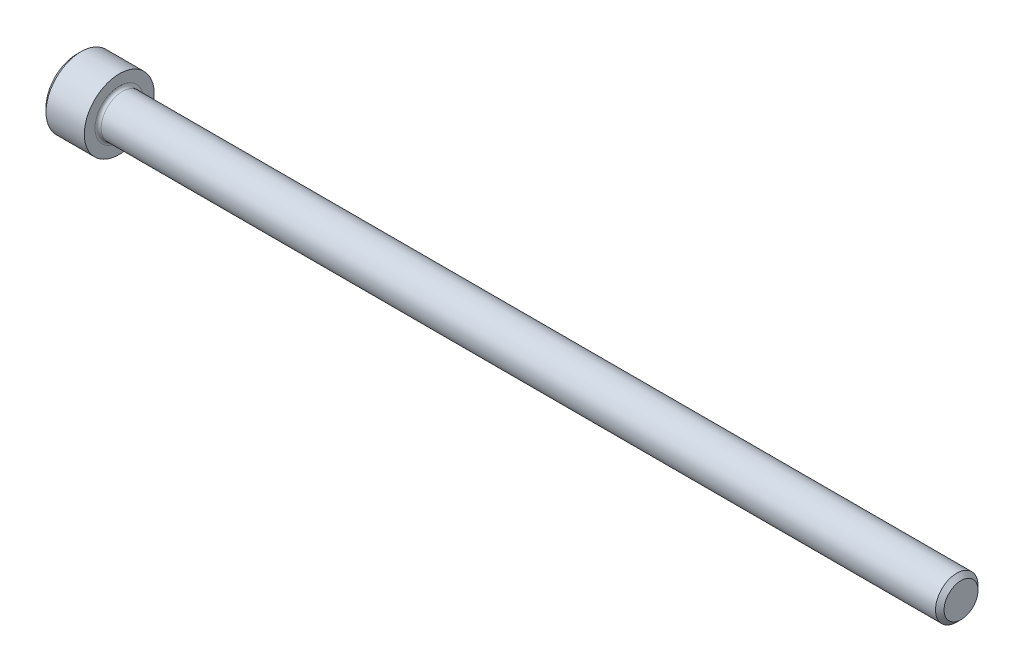
ISO-10303-21;
HEADER;
FILE_DESCRIPTION(('STEP AP214'),'2;1');
FILE_NAME('part.step','',(''),(''),'','','');
FILE_SCHEMA(('AUTOMOTIVE_DESIGN { 1 0 10303 214 1 1 1 1 }'));
ENDSEC;
DATA;
#1=APPLICATION_CONTEXT('core data for automotive mechanical design processes');
#2=APPLICATION_PROTOCOL_DEFINITION('international standard','automotive_design',2000,#1);
#3=PRODUCT_CONTEXT('',#1,'mechanical');
#4=PRODUCT('Part','Part','',(#3));
#5=PRODUCT_RELATED_PRODUCT_CATEGORY('part','',(#4));
#6=PRODUCT_DEFINITION_FORMATION('','',#4);
#7=PRODUCT_DEFINITION_CONTEXT('part definition',#1,'design');
#8=PRODUCT_DEFINITION('design','',#6,#7);
#9=PRODUCT_DEFINITION_SHAPE('','',#8);
#10=(LENGTH_UNIT() NAMED_UNIT(*) SI_UNIT(.MILLI.,.METRE.));
#11=(NAMED_UNIT(*) PLANE_ANGLE_UNIT() SI_UNIT($,.RADIAN.));
#12=(NAMED_UNIT(*) SI_UNIT($,.STERADIAN.) SOLID_ANGLE_UNIT());
#13=UNCERTAINTY_MEASURE_WITH_UNIT(LENGTH_MEASURE(1.E-05),#10,'distance_accuracy_value','');
#14=(GEOMETRIC_REPRESENTATION_CONTEXT(3) GLOBAL_UNCERTAINTY_ASSIGNED_CONTEXT((#13)) GLOBAL_UNIT_ASSIGNED_CONTEXT((#10,
#11,#12)) REPRESENTATION_CONTEXT('',''));
#15=CARTESIAN_POINT('',(0.,0.,0.));
#16=DIRECTION('',(0.,0.,1.));
#17=DIRECTION('',(1.,0.,0.));
#18=AXIS2_PLACEMENT_3D('',#15,#16,#17);
#19=CARTESIAN_POINT('',(0.,0.,0.));
#20=DIRECTION('',(-1.,0.,0.));
#21=DIRECTION('',(0.,0.,1.));
#22=AXIS2_PLACEMENT_3D('',#19,#20,#21);
#23=PLANE('',#22);
#24=DIRECTION('',(0.,-0.499999999999999,0.866025403784439));
#25=VECTOR('',#24,1.);
#26=CARTESIAN_POINT('',(0.,2.05305755723831,0.));
#27=LINE('',#26,#25);
#28=CARTESIAN_POINT('',(0.,2.05305755723831,0.));
#29=VERTEX_POINT('',#28);
#30=CARTESIAN_POINT('',(0.,1.02652877861916,1.778));
#31=VERTEX_POINT('',#30);
#32=EDGE_CURVE('E373',#29,#31,#27,.T.);
#33=ORIENTED_EDGE('',*,*,#32,.T.);
#34=DIRECTION('',(0.,1.,0.));
#35=VECTOR('',#34,1.);
#36=CARTESIAN_POINT('',(0.,-1.02652877861915,1.778));
#37=LINE('',#36,#35);
#38=CARTESIAN_POINT('',(0.,-1.02652877861915,1.778));
#39=VERTEX_POINT('',#38);
#40=EDGE_CURVE('E129',#39,#31,#37,.T.);
#41=ORIENTED_EDGE('',*,*,#40,.F.);
#42=DIRECTION('',(0.,-0.500000000000001,-0.866025403784438));
#43=VECTOR('',#42,1.);
#44=CARTESIAN_POINT('',(0.,-1.02652877861915,1.778));
#45=LINE('',#44,#43);
#46=CARTESIAN_POINT('',(0.,-2.05305755723831,0.));
#47=VERTEX_POINT('',#46);
#48=EDGE_CURVE('E376',#39,#47,#45,.T.);
#49=ORIENTED_EDGE('',*,*,#48,.T.);
#50=DIRECTION('',(0.,0.499999999999999,-0.866025403784439));
#51=VECTOR('',#50,1.);
#52=CARTESIAN_POINT('',(0.,-2.05305755723831,0.));
#53=LINE('',#52,#51);
#54=CARTESIAN_POINT('',(0.,-1.02652877861915,-1.778));
#55=VERTEX_POINT('',#54);
#56=EDGE_CURVE('E379',#47,#55,#53,.T.);
#57=ORIENTED_EDGE('',*,*,#56,.T.);
#58=DIRECTION('',(0.,-1.,0.));
#59=VECTOR('',#58,1.);
#60=CARTESIAN_POINT('',(0.,1.02652877861916,-1.778));
#61=LINE('',#60,#59);
#62=CARTESIAN_POINT('',(0.,1.02652877861916,-1.778));
#63=VERTEX_POINT('',#62);
#64=EDGE_CURVE('E382',#63,#55,#61,.T.);
#65=ORIENTED_EDGE('',*,*,#64,.F.);
#66=DIRECTION('',(0.,-0.500000000000001,-0.866025403784438));
#67=VECTOR('',#66,1.);
#68=CARTESIAN_POINT('',(0.,2.05305755723831,0.));
#69=LINE('',#68,#67);
#70=EDGE_CURVE('E124',#29,#63,#69,.T.);
#71=ORIENTED_EDGE('',*,*,#70,.F.);
#72=EDGE_LOOP('',(#33,#41,#49,#57,#65,#71));
#73=FACE_BOUND('',#72,.T.);
#74=CARTESIAN_POINT('',(0.,0.,0.));
#75=DIRECTION('',(-1.,0.,0.));
#76=DIRECTION('',(0.,0.,1.));
#77=AXIS2_PLACEMENT_3D('',#74,#75,#76);
#78=CIRCLE('',#77,3.0226);
#79=CARTESIAN_POINT('',(0.,0.,3.0226));
#80=VERTEX_POINT('',#79);
#81=EDGE_CURVE('E140',#80,#80,#78,.T.);
#82=ORIENTED_EDGE('',*,*,#81,.T.);
#83=EDGE_LOOP('',(#82));
#84=FACE_BOUND('',#83,.T.);
#85=ADVANCED_FACE('F33',(#73,#84),#23,.T.);
#86=CARTESIAN_POINT('',(86.7156,1.66243,0.));
#87=DIRECTION('',(1.,0.,0.));
#88=DIRECTION('',(0.,0.,-1.));
#89=AXIS2_PLACEMENT_3D('',#86,#87,#88);
#90=PLANE('',#89);
#91=CARTESIAN_POINT('',(86.7156,0.,0.));
#92=DIRECTION('',(-1.,0.,0.));
#93=DIRECTION('',(0.,0.,1.));
#94=AXIS2_PLACEMENT_3D('',#91,#92,#93);
#95=CIRCLE('',#94,1.66243);
#96=CARTESIAN_POINT('',(86.7156,0.,1.66243));
#97=VERTEX_POINT('',#96);
#98=EDGE_CURVE('E153',#97,#97,#95,.T.);
#99=ORIENTED_EDGE('',*,*,#98,.F.);
#100=EDGE_LOOP('',(#99));
#101=FACE_BOUND('',#100,.T.);
#102=ADVANCED_FACE('F174',(#101),#90,.T.);
#103=CARTESIAN_POINT('',(86.7156,0.,0.));
#104=DIRECTION('',(-1.,0.,0.));
#105=DIRECTION('',(0.,0.,1.));
#106=AXIS2_PLACEMENT_3D('',#103,#104,#105);
#107=CONICAL_SURFACE('',#106,1.66243,0.785398163397446);
#108=CARTESIAN_POINT('',(86.29523,0.,0.));
#109=DIRECTION('',(-1.,0.,0.));
#110=DIRECTION('',(0.,0.,1.));
#111=AXIS2_PLACEMENT_3D('',#108,#109,#110);
#112=CIRCLE('',#111,2.0828);
#113=CARTESIAN_POINT('',(86.29523,0.,2.0828));
#114=VERTEX_POINT('',#113);
#115=EDGE_CURVE('E150',#114,#114,#112,.T.);
#116=ORIENTED_EDGE('',*,*,#115,.F.);
#117=EDGE_LOOP('',(#116));
#118=FACE_BOUND('',#117,.T.);
#119=ORIENTED_EDGE('',*,*,#98,.T.);
#120=EDGE_LOOP('',(#119));
#121=FACE_BOUND('',#120,.T.);
#122=ADVANCED_FACE('F180',(#118,#121),#107,.T.);
#123=CARTESIAN_POINT('',(-31.75,0.,0.));
#124=DIRECTION('',(-1.,0.,0.));
#125=DIRECTION('',(0.,0.,1.));
#126=AXIS2_PLACEMENT_3D('',#123,#124,#125);
#127=CYLINDRICAL_SURFACE('',#126,2.0828);
#128=CARTESIAN_POINT('',(4.47040000000001,0.,0.));
#129=DIRECTION('',(1.,0.,0.));
#130=DIRECTION('',(0.,0.,-1.));
#131=AXIS2_PLACEMENT_3D('',#128,#129,#130);
#132=CIRCLE('',#131,2.0828);
#133=CARTESIAN_POINT('',(4.47040000000001,0.,-2.0828));
#134=VERTEX_POINT('',#133);
#135=EDGE_CURVE('E11',#134,#134,#132,.T.);
#136=ORIENTED_EDGE('',*,*,#135,.T.);
#137=EDGE_LOOP('',(#136));
#138=FACE_BOUND('',#137,.T.);
#139=ORIENTED_EDGE('',*,*,#115,.T.);
#140=EDGE_LOOP('',(#139));
#141=FACE_BOUND('',#140,.T.);
#142=ADVANCED_FACE('F191',(#138,#141),#127,.T.);
#143=CARTESIAN_POINT('',(4.1656,3.429,0.));
#144=DIRECTION('',(1.,0.,0.));
#145=DIRECTION('',(0.,0.,-1.));
#146=AXIS2_PLACEMENT_3D('',#143,#144,#145);
#147=PLANE('',#146);
#148=CARTESIAN_POINT('',(4.1656,0.,0.));
#149=DIRECTION('',(1.,0.,0.));
#150=DIRECTION('',(0.,0.,-1.));
#151=AXIS2_PLACEMENT_3D('',#148,#149,#150);
#152=CIRCLE('',#151,2.3876);
#153=CARTESIAN_POINT('',(4.1656,0.,-2.3876));
#154=VERTEX_POINT('',#153);
#155=EDGE_CURVE('E41',#154,#154,#152,.F.);
#156=ORIENTED_EDGE('',*,*,#155,.T.);
#157=EDGE_LOOP('',(#156));
#158=FACE_BOUND('',#157,.T.);
#159=CARTESIAN_POINT('',(4.1656,0.,0.));
#160=DIRECTION('',(-1.,0.,0.));
#161=DIRECTION('',(0.,0.,1.));
#162=AXIS2_PLACEMENT_3D('',#159,#160,#161);
#163=CIRCLE('',#162,3.429);
#164=CARTESIAN_POINT('',(4.1656,0.,3.429));
#165=VERTEX_POINT('',#164);
#166=EDGE_CURVE('E147',#165,#165,#163,.T.);
#167=ORIENTED_EDGE('',*,*,#166,.F.);
#168=EDGE_LOOP('',(#167));
#169=FACE_BOUND('',#168,.T.);
#170=ADVANCED_FACE('F158',(#158,#169),#147,.T.);
#171=CARTESIAN_POINT('',(-31.75,0.,0.));
#172=DIRECTION('',(-1.,0.,0.));
#173=DIRECTION('',(0.,0.,1.));
#174=AXIS2_PLACEMENT_3D('',#171,#172,#173);
#175=CYLINDRICAL_SURFACE('',#174,3.429);
#176=ORIENTED_EDGE('',*,*,#166,.T.);
#177=EDGE_LOOP('',(#176));
#178=FACE_BOUND('',#177,.T.);
#179=CARTESIAN_POINT('',(0.406400000000001,0.,0.));
#180=DIRECTION('',(-1.,0.,0.));
#181=DIRECTION('',(0.,0.,1.));
#182=AXIS2_PLACEMENT_3D('',#179,#180,#181);
#183=CIRCLE('',#182,3.429);
#184=CARTESIAN_POINT('',(0.406400000000001,0.,3.429));
#185=VERTEX_POINT('',#184);
#186=EDGE_CURVE('E144',#185,#185,#183,.T.);
#187=ORIENTED_EDGE('',*,*,#186,.F.);
#188=EDGE_LOOP('',(#187));
#189=FACE_BOUND('',#188,.T.);
#190=ADVANCED_FACE('F169',(#178,#189),#175,.T.);
#191=CARTESIAN_POINT('',(0.,0.,0.));
#192=DIRECTION('',(1.,0.,0.));
#193=DIRECTION('',(0.,0.,-1.));
#194=AXIS2_PLACEMENT_3D('',#191,#192,#193);
#195=CONICAL_SURFACE('',#194,3.0226,0.785398163397444);
#196=ORIENTED_EDGE('',*,*,#186,.T.);
#197=EDGE_LOOP('',(#196));
#198=FACE_BOUND('',#197,.T.);
#199=ORIENTED_EDGE('',*,*,#81,.F.);
#200=EDGE_LOOP('',(#199));
#201=FACE_BOUND('',#200,.T.);
#202=ADVANCED_FACE('F162',(#198,#201),#195,.T.);
#203=CARTESIAN_POINT('',(4.47040000000001,0.,0.));
#204=DIRECTION('',(1.,0.,0.));
#205=DIRECTION('',(0.,0.,-1.));
#206=AXIS2_PLACEMENT_3D('',#203,#204,#205);
#207=TOROIDAL_SURFACE('',#206,2.3876,0.3048);
#208=ORIENTED_EDGE('',*,*,#135,.F.);
#209=EDGE_LOOP('',(#208));
#210=FACE_BOUND('',#209,.T.);
#211=ORIENTED_EDGE('',*,*,#155,.F.);
#212=EDGE_LOOP('',(#211));
#213=FACE_BOUND('',#212,.T.);
#214=ADVANCED_FACE('F35',(#210,#213),#207,.F.);
#215=CARTESIAN_POINT('',(1.9558,2.05305755723831,0.));
#216=DIRECTION('',(0.,-0.866025403784439,-0.499999999999999));
#217=DIRECTION('',(0.,0.499999999999999,-0.866025403784439));
#218=AXIS2_PLACEMENT_3D('',#215,#216,#217);
#219=PLANE('',#218);
#220=ORIENTED_EDGE('',*,*,#32,.F.);
#221=DIRECTION('',(-1.,0.,0.));
#222=VECTOR('',#221,1.);
#223=CARTESIAN_POINT('',(1.9558,2.05305755723831,0.));
#224=LINE('',#223,#222);
#225=CARTESIAN_POINT('',(1.9558,2.05305755723831,0.));
#226=VERTEX_POINT('',#225);
#227=EDGE_CURVE('E363',#226,#29,#224,.T.);
#228=ORIENTED_EDGE('',*,*,#227,.F.);
#229=DIRECTION('',(0.,-0.499999999999999,0.866025403784439));
#230=VECTOR('',#229,1.);
#231=CARTESIAN_POINT('',(1.9558,2.05305755723831,0.));
#232=LINE('',#231,#230);
#233=CARTESIAN_POINT('',(1.9558,1.53979316792874,0.889));
#234=VERTEX_POINT('',#233);
#235=EDGE_CURVE('E116',#226,#234,#232,.T.);
#236=ORIENTED_EDGE('',*,*,#235,.T.);
#237=CARTESIAN_POINT('',(1.9558,1.02652877861916,1.778));
#238=VERTEX_POINT('',#237);
#239=EDGE_CURVE('E107',#234,#238,#232,.T.);
#240=ORIENTED_EDGE('',*,*,#239,.T.);
#241=DIRECTION('',(-1.,0.,0.));
#242=VECTOR('',#241,1.);
#243=CARTESIAN_POINT('',(1.9558,1.02652877861916,1.778));
#244=LINE('',#243,#242);
#245=EDGE_CURVE('E121',#238,#31,#244,.T.);
#246=ORIENTED_EDGE('',*,*,#245,.T.);
#247=EDGE_LOOP('',(#220,#228,#236,#240,#246));
#248=FACE_BOUND('',#247,.T.);
#249=ADVANCED_FACE('F120',(#248),#219,.T.);
#250=CARTESIAN_POINT('',(1.9558,-1.02652877861915,1.778));
#251=DIRECTION('',(0.,0.,1.));
#252=DIRECTION('',(0.,-1.,0.));
#253=AXIS2_PLACEMENT_3D('',#250,#251,#252);
#254=PLANE('',#253);
#255=ORIENTED_EDGE('',*,*,#40,.T.);
#256=ORIENTED_EDGE('',*,*,#245,.F.);
#257=DIRECTION('',(0.,1.,0.));
#258=VECTOR('',#257,1.);
#259=CARTESIAN_POINT('',(1.9558,-1.02652877861915,1.778));
#260=LINE('',#259,#258);
#261=CARTESIAN_POINT('',(1.9558,0.,1.778));
#262=VERTEX_POINT('',#261);
#263=EDGE_CURVE('E104',#262,#238,#260,.T.);
#264=ORIENTED_EDGE('',*,*,#263,.F.);
#265=CARTESIAN_POINT('',(1.9558,-1.02652877861915,1.778));
#266=VERTEX_POINT('',#265);
#267=EDGE_CURVE('E115',#266,#262,#260,.T.);
#268=ORIENTED_EDGE('',*,*,#267,.F.);
#269=DIRECTION('',(-1.,0.,0.));
#270=VECTOR('',#269,1.);
#271=CARTESIAN_POINT('',(1.9558,-1.02652877861915,1.778));
#272=LINE('',#271,#270);
#273=EDGE_CURVE('E131',#266,#39,#272,.T.);
#274=ORIENTED_EDGE('',*,*,#273,.T.);
#275=EDGE_LOOP('',(#255,#256,#264,#268,#274));
#276=FACE_BOUND('',#275,.T.);
#277=ADVANCED_FACE('F126',(#276),#254,.F.);
#278=CARTESIAN_POINT('',(1.9558,-1.02652877861915,1.778));
#279=DIRECTION('',(0.,0.866025403784438,-0.500000000000001));
#280=DIRECTION('',(0.,0.500000000000001,0.866025403784438));
#281=AXIS2_PLACEMENT_3D('',#278,#279,#280);
#282=PLANE('',#281);
#283=ORIENTED_EDGE('',*,*,#48,.F.);
#284=ORIENTED_EDGE('',*,*,#273,.F.);
#285=DIRECTION('',(0.,-0.500000000000001,-0.866025403784438));
#286=VECTOR('',#285,1.);
#287=CARTESIAN_POINT('',(1.9558,-1.02652877861915,1.778));
#288=LINE('',#287,#286);
#289=CARTESIAN_POINT('',(1.9558,-1.53979316792873,0.889));
#290=VERTEX_POINT('',#289);
#291=EDGE_CURVE('E402',#266,#290,#288,.T.);
#292=ORIENTED_EDGE('',*,*,#291,.T.);
#293=CARTESIAN_POINT('',(1.9558,-2.05305755723831,0.));
#294=VERTEX_POINT('',#293);
#295=EDGE_CURVE('E391',#290,#294,#288,.T.);
#296=ORIENTED_EDGE('',*,*,#295,.T.);
#297=DIRECTION('',(-1.,0.,0.));
#298=VECTOR('',#297,1.);
#299=CARTESIAN_POINT('',(1.9558,-2.05305755723831,0.));
#300=LINE('',#299,#298);
#301=EDGE_CURVE('E136',#294,#47,#300,.T.);
#302=ORIENTED_EDGE('',*,*,#301,.T.);
#303=EDGE_LOOP('',(#283,#284,#292,#296,#302));
#304=FACE_BOUND('',#303,.T.);
#305=ADVANCED_FACE('F254',(#304),#282,.T.);
#306=CARTESIAN_POINT('',(1.9558,-2.05305755723831,0.));
#307=DIRECTION('',(0.,0.866025403784439,0.499999999999999));
#308=DIRECTION('',(0.,-0.499999999999999,0.866025403784439));
#309=AXIS2_PLACEMENT_3D('',#306,#307,#308);
#310=PLANE('',#309);
#311=ORIENTED_EDGE('',*,*,#56,.F.);
#312=ORIENTED_EDGE('',*,*,#301,.F.);
#313=DIRECTION('',(0.,0.499999999999999,-0.866025403784439));
#314=VECTOR('',#313,1.);
#315=CARTESIAN_POINT('',(1.9558,-2.05305755723831,0.));
#316=LINE('',#315,#314);
#317=CARTESIAN_POINT('',(1.9558,-1.53979316792873,-0.888999999999996));
#318=VERTEX_POINT('',#317);
#319=EDGE_CURVE('E369',#294,#318,#316,.T.);
#320=ORIENTED_EDGE('',*,*,#319,.T.);
#321=CARTESIAN_POINT('',(1.9558,-1.02652877861915,-1.778));
#322=VERTEX_POINT('',#321);
#323=EDGE_CURVE('E401',#318,#322,#316,.T.);
#324=ORIENTED_EDGE('',*,*,#323,.T.);
#325=DIRECTION('',(-1.,0.,0.));
#326=VECTOR('',#325,1.);
#327=CARTESIAN_POINT('',(1.9558,-1.02652877861915,-1.778));
#328=LINE('',#327,#326);
#329=EDGE_CURVE('E362',#322,#55,#328,.T.);
#330=ORIENTED_EDGE('',*,*,#329,.T.);
#331=EDGE_LOOP('',(#311,#312,#320,#324,#330));
#332=FACE_BOUND('',#331,.T.);
#333=ADVANCED_FACE('F262',(#332),#310,.T.);
#334=CARTESIAN_POINT('',(1.9558,1.02652877861916,-1.778));
#335=DIRECTION('',(0.,0.,-1.));
#336=DIRECTION('',(0.,1.,0.));
#337=AXIS2_PLACEMENT_3D('',#334,#335,#336);
#338=PLANE('',#337);
#339=ORIENTED_EDGE('',*,*,#64,.T.);
#340=ORIENTED_EDGE('',*,*,#329,.F.);
#341=DIRECTION('',(0.,-1.,0.));
#342=VECTOR('',#341,1.);
#343=CARTESIAN_POINT('',(1.9558,1.02652877861916,-1.778));
#344=LINE('',#343,#342);
#345=CARTESIAN_POINT('',(1.9558,0.,-1.778));
#346=VERTEX_POINT('',#345);
#347=EDGE_CURVE('E366',#346,#322,#344,.T.);
#348=ORIENTED_EDGE('',*,*,#347,.F.);
#349=CARTESIAN_POINT('',(1.9558,1.02652877861916,-1.778));
#350=VERTEX_POINT('',#349);
#351=EDGE_CURVE('E48',#350,#346,#344,.T.);
#352=ORIENTED_EDGE('',*,*,#351,.F.);
#353=DIRECTION('',(-1.,0.,0.));
#354=VECTOR('',#353,1.);
#355=CARTESIAN_POINT('',(1.9558,1.02652877861916,-1.778));
#356=LINE('',#355,#354);
#357=EDGE_CURVE('E359',#350,#63,#356,.T.);
#358=ORIENTED_EDGE('',*,*,#357,.T.);
#359=EDGE_LOOP('',(#339,#340,#348,#352,#358));
#360=FACE_BOUND('',#359,.T.);
#361=ADVANCED_FACE('F271',(#360),#338,.F.);
#362=CARTESIAN_POINT('',(1.9558,2.05305755723831,0.));
#363=DIRECTION('',(0.,0.866025403784438,-0.500000000000001));
#364=DIRECTION('',(0.,0.500000000000001,0.866025403784438));
#365=AXIS2_PLACEMENT_3D('',#362,#363,#364);
#366=PLANE('',#365);
#367=ORIENTED_EDGE('',*,*,#70,.T.);
#368=ORIENTED_EDGE('',*,*,#357,.F.);
#369=DIRECTION('',(0.,-0.500000000000001,-0.866025403784438));
#370=VECTOR('',#369,1.);
#371=CARTESIAN_POINT('',(1.9558,2.05305755723831,0.));
#372=LINE('',#371,#370);
#373=CARTESIAN_POINT('',(1.9558,1.53979316792873,-0.889000000000004));
#374=VERTEX_POINT('',#373);
#375=EDGE_CURVE('E349',#374,#350,#372,.T.);
#376=ORIENTED_EDGE('',*,*,#375,.F.);
#377=EDGE_CURVE('E355',#226,#374,#372,.T.);
#378=ORIENTED_EDGE('',*,*,#377,.F.);
#379=ORIENTED_EDGE('',*,*,#227,.T.);
#380=EDGE_LOOP('',(#367,#368,#376,#378,#379));
#381=FACE_BOUND('',#380,.T.);
#382=ADVANCED_FACE('F280',(#381),#366,.F.);
#383=CARTESIAN_POINT('',(1.9558,2.05305755723831,0.));
#384=DIRECTION('',(1.,0.,0.));
#385=DIRECTION('',(0.,0.,-1.));
#386=AXIS2_PLACEMENT_3D('',#383,#384,#385);
#387=PLANE('',#386);
#388=ORIENTED_EDGE('',*,*,#347,.T.);
#389=ORIENTED_EDGE('',*,*,#323,.F.);
#390=CARTESIAN_POINT('',(1.9558,0.,0.));
#391=DIRECTION('',(-1.,0.,0.));
#392=DIRECTION('',(0.,0.,1.));
#393=AXIS2_PLACEMENT_3D('',#390,#391,#392);
#394=CIRCLE('',#393,1.778);
#395=EDGE_CURVE('E397',#346,#318,#394,.T.);
#396=ORIENTED_EDGE('',*,*,#395,.F.);
#397=EDGE_LOOP('',(#388,#389,#396));
#398=FACE_BOUND('',#397,.T.);
#399=ADVANCED_FACE('F289',(#398),#387,.F.);
#400=ORIENTED_EDGE('',*,*,#319,.F.);
#401=ORIENTED_EDGE('',*,*,#295,.F.);
#402=EDGE_CURVE('E134',#318,#290,#394,.T.);
#403=ORIENTED_EDGE('',*,*,#402,.F.);
#404=EDGE_LOOP('',(#400,#401,#403));
#405=FACE_BOUND('',#404,.T.);
#406=ADVANCED_FACE('F298',(#405),#387,.F.);
#407=ORIENTED_EDGE('',*,*,#291,.F.);
#408=ORIENTED_EDGE('',*,*,#267,.T.);
#409=EDGE_CURVE('E130',#290,#262,#394,.T.);
#410=ORIENTED_EDGE('',*,*,#409,.F.);
#411=EDGE_LOOP('',(#407,#408,#410));
#412=FACE_BOUND('',#411,.T.);
#413=ADVANCED_FACE('F307',(#412),#387,.F.);
#414=ORIENTED_EDGE('',*,*,#263,.T.);
#415=ORIENTED_EDGE('',*,*,#239,.F.);
#416=EDGE_CURVE('E110',#262,#234,#394,.T.);
#417=ORIENTED_EDGE('',*,*,#416,.F.);
#418=EDGE_LOOP('',(#414,#415,#417));
#419=FACE_BOUND('',#418,.T.);
#420=ADVANCED_FACE('F106',(#419),#387,.F.);
#421=ORIENTED_EDGE('',*,*,#235,.F.);
#422=ORIENTED_EDGE('',*,*,#377,.T.);
#423=EDGE_CURVE('E141',#234,#374,#394,.T.);
#424=ORIENTED_EDGE('',*,*,#423,.F.);
#425=EDGE_LOOP('',(#421,#422,#424));
#426=FACE_BOUND('',#425,.T.);
#427=ADVANCED_FACE('F322',(#426),#387,.F.);
#428=ORIENTED_EDGE('',*,*,#375,.T.);
#429=ORIENTED_EDGE('',*,*,#351,.T.);
#430=EDGE_CURVE('E352',#374,#346,#394,.T.);
#431=ORIENTED_EDGE('',*,*,#430,.F.);
#432=EDGE_LOOP('',(#428,#429,#431));
#433=FACE_BOUND('',#432,.T.);
#434=ADVANCED_FACE('F237',(#433),#387,.F.);
#435=CARTESIAN_POINT('',(1.9558,0.,0.));
#436=DIRECTION('',(-1.,0.,0.));
#437=DIRECTION('',(0.,0.,1.));
#438=AXIS2_PLACEMENT_3D('',#435,#436,#437);
#439=CONICAL_SURFACE('',#438,1.778,1.04719755119659);
#440=CARTESIAN_POINT('',(2.98232877861917,0.,0.));
#441=VERTEX_POINT('',#440);
#442=VERTEX_LOOP('',#441);
#443=FACE_BOUND('',#442,.T.);
#444=ORIENTED_EDGE('',*,*,#416,.T.);
#445=ORIENTED_EDGE('',*,*,#423,.T.);
#446=ORIENTED_EDGE('',*,*,#430,.T.);
#447=ORIENTED_EDGE('',*,*,#395,.T.);
#448=ORIENTED_EDGE('',*,*,#402,.T.);
#449=ORIENTED_EDGE('',*,*,#409,.T.);
#450=EDGE_LOOP('',(#444,#445,#446,#447,#448,#449));
#451=FACE_BOUND('',#450,.T.);
#452=ADVANCED_FACE('F184',(#443,#451),#439,.F.);
#453=CLOSED_SHELL('',(#85,#102,#122,#142,#170,#190,#202,#214,#249,#277,#305,#333,#361,#382,#399,
#406,#413,#420,#427,#434,#452));
#454=MANIFOLD_SOLID_BREP('B2',#453);
#455=ADVANCED_BREP_SHAPE_REPRESENTATION('',(#18,#454),#14);
#456=SHAPE_DEFINITION_REPRESENTATION(#9,#455);
ENDSEC;
END-ISO-10303-21;
